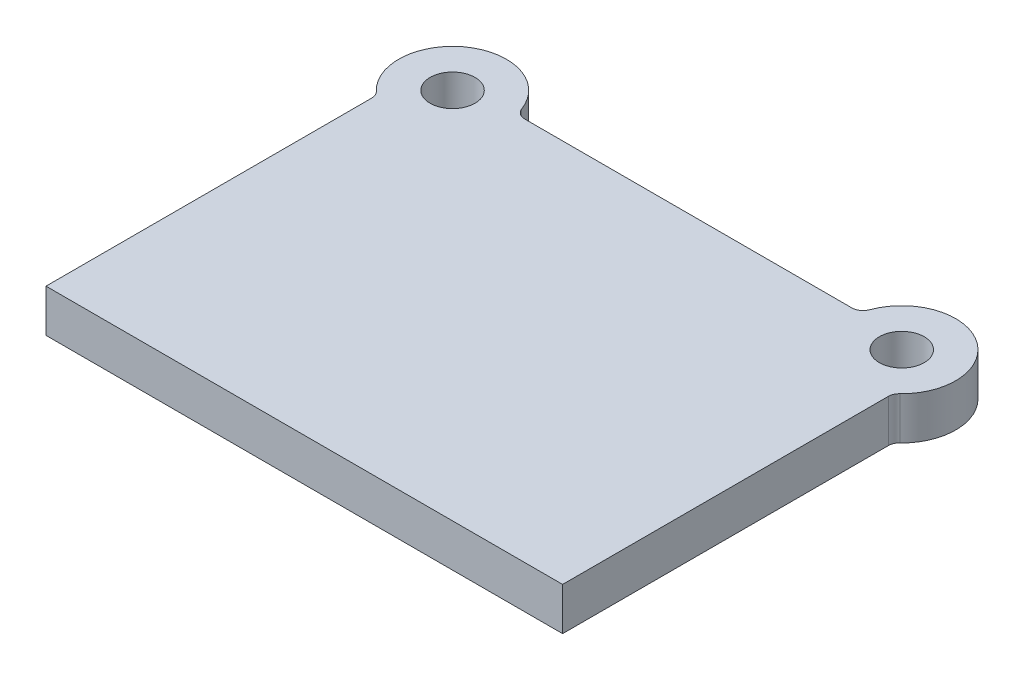
ISO-10303-21;
HEADER;
FILE_DESCRIPTION(('STEP AP214'),'2;1');
FILE_NAME('part.step','',(''),(''),'','','');
FILE_SCHEMA(('AUTOMOTIVE_DESIGN { 1 0 10303 214 1 1 1 1 }'));
ENDSEC;
DATA;
#1=APPLICATION_CONTEXT('core data for automotive mechanical design processes');
#2=APPLICATION_PROTOCOL_DEFINITION('international standard','automotive_design',2000,#1);
#3=PRODUCT_CONTEXT('',#1,'mechanical');
#4=PRODUCT('Part','Part','',(#3));
#5=PRODUCT_RELATED_PRODUCT_CATEGORY('part','',(#4));
#6=PRODUCT_DEFINITION_FORMATION('','',#4);
#7=PRODUCT_DEFINITION_CONTEXT('part definition',#1,'design');
#8=PRODUCT_DEFINITION('design','',#6,#7);
#9=PRODUCT_DEFINITION_SHAPE('','',#8);
#10=(LENGTH_UNIT() NAMED_UNIT(*) SI_UNIT(.MILLI.,.METRE.));
#11=(NAMED_UNIT(*) PLANE_ANGLE_UNIT() SI_UNIT($,.RADIAN.));
#12=(NAMED_UNIT(*) SI_UNIT($,.STERADIAN.) SOLID_ANGLE_UNIT());
#13=UNCERTAINTY_MEASURE_WITH_UNIT(LENGTH_MEASURE(1.E-05),#10,'distance_accuracy_value','');
#14=(GEOMETRIC_REPRESENTATION_CONTEXT(3) GLOBAL_UNCERTAINTY_ASSIGNED_CONTEXT((#13)) GLOBAL_UNIT_ASSIGNED_CONTEXT((#10,
#11,#12)) REPRESENTATION_CONTEXT('',''));
#15=CARTESIAN_POINT('',(0.,0.,0.));
#16=DIRECTION('',(0.,0.,1.));
#17=DIRECTION('',(1.,0.,0.));
#18=AXIS2_PLACEMENT_3D('',#15,#16,#17);
#19=CARTESIAN_POINT('',(-200.,38.,-332.));
#20=DIRECTION('',(0.,1.,0.));
#21=DIRECTION('',(0.,0.,1.));
#22=AXIS2_PLACEMENT_3D('',#19,#20,#21);
#23=PLANE('',#22);
#24=CARTESIAN_POINT('',(-200.,38.,-332.));
#25=DIRECTION('',(0.,1.,0.));
#26=DIRECTION('',(0.,0.,1.));
#27=AXIS2_PLACEMENT_3D('',#24,#25,#26);
#28=CIRCLE('',#27,20.);
#29=CARTESIAN_POINT('',(-200.,38.,-312.));
#30=VERTEX_POINT('',#29);
#31=EDGE_CURVE('E197',#30,#30,#28,.T.);
#32=ORIENTED_EDGE('',*,*,#31,.F.);
#33=EDGE_LOOP('',(#32));
#34=FACE_BOUND('',#33,.T.);
#35=CARTESIAN_POINT('',(-200.,38.,-332.));
#36=DIRECTION('',(0.,1.,0.));
#37=DIRECTION('',(0.,0.,1.));
#38=AXIS2_PLACEMENT_3D('',#35,#36,#37);
#39=CIRCLE('',#38,48.);
#40=CARTESIAN_POINT('',(-154.944030050815,38.,-348.551724137931));
#41=VERTEX_POINT('',#40);
#42=CARTESIAN_POINT('',(-233.103448275862,38.,-297.241379310345));
#43=VERTEX_POINT('',#42);
#44=EDGE_CURVE('E140',#41,#43,#39,.T.);
#45=ORIENTED_EDGE('',*,*,#44,.T.);
#46=CARTESIAN_POINT('',(-240.,38.,-290.));
#47=DIRECTION('',(0.,1.,0.));
#48=DIRECTION('',(0.,0.,1.));
#49=AXIS2_PLACEMENT_3D('',#46,#47,#48);
#50=CIRCLE('',#49,10.);
#51=CARTESIAN_POINT('',(-230.,38.,-290.));
#52=VERTEX_POINT('',#51);
#53=EDGE_CURVE('E116',#43,#52,#50,.F.);
#54=ORIENTED_EDGE('',*,*,#53,.T.);
#55=DIRECTION('',(0.,0.,1.));
#56=VECTOR('',#55,1.);
#57=CARTESIAN_POINT('',(-230.,38.,0.));
#58=LINE('',#57,#56);
#59=CARTESIAN_POINT('',(-230.,38.,0.));
#60=VERTEX_POINT('',#59);
#61=EDGE_CURVE('E108',#52,#60,#58,.T.);
#62=ORIENTED_EDGE('',*,*,#61,.T.);
#63=DIRECTION('',(1.,0.,0.));
#64=VECTOR('',#63,1.);
#65=CARTESIAN_POINT('',(230.,38.,0.));
#66=LINE('',#65,#64);
#67=CARTESIAN_POINT('',(230.,38.,0.));
#68=VERTEX_POINT('',#67);
#69=EDGE_CURVE('E113',#60,#68,#66,.T.);
#70=ORIENTED_EDGE('',*,*,#69,.T.);
#71=DIRECTION('',(0.,0.,-1.));
#72=VECTOR('',#71,1.);
#73=CARTESIAN_POINT('',(230.,38.,0.));
#74=LINE('',#73,#72);
#75=CARTESIAN_POINT('',(230.,38.,-290.));
#76=VERTEX_POINT('',#75);
#77=EDGE_CURVE('E130',#68,#76,#74,.T.);
#78=ORIENTED_EDGE('',*,*,#77,.T.);
#79=CARTESIAN_POINT('',(240.,38.,-290.));
#80=DIRECTION('',(0.,1.,0.));
#81=DIRECTION('',(0.,0.,1.));
#82=AXIS2_PLACEMENT_3D('',#79,#80,#81);
#83=CIRCLE('',#82,10.);
#84=CARTESIAN_POINT('',(233.103448275862,38.,-297.241379310345));
#85=VERTEX_POINT('',#84);
#86=EDGE_CURVE('E164',#76,#85,#83,.F.);
#87=ORIENTED_EDGE('',*,*,#86,.T.);
#88=CARTESIAN_POINT('',(200.,38.,-332.));
#89=DIRECTION('',(0.,1.,0.));
#90=DIRECTION('',(0.,0.,-1.));
#91=AXIS2_PLACEMENT_3D('',#88,#89,#90);
#92=CIRCLE('',#91,48.);
#93=CARTESIAN_POINT('',(154.944030050815,38.,-348.551724137931));
#94=VERTEX_POINT('',#93);
#95=EDGE_CURVE('E189',#85,#94,#92,.T.);
#96=ORIENTED_EDGE('',*,*,#95,.T.);
#97=CARTESIAN_POINT('',(145.557369644735,38.,-352.));
#98=DIRECTION('',(0.,1.,0.));
#99=DIRECTION('',(0.,0.,1.));
#100=AXIS2_PLACEMENT_3D('',#97,#98,#99);
#101=CIRCLE('',#100,10.);
#102=CARTESIAN_POINT('',(145.557369644735,38.,-342.));
#103=VERTEX_POINT('',#102);
#104=EDGE_CURVE('E11',#94,#103,#101,.F.);
#105=ORIENTED_EDGE('',*,*,#104,.T.);
#106=DIRECTION('',(-1.,0.,0.));
#107=VECTOR('',#106,1.);
#108=CARTESIAN_POINT('',(153.053221622778,38.,-342.));
#109=LINE('',#108,#107);
#110=CARTESIAN_POINT('',(-145.557369644735,38.,-342.));
#111=VERTEX_POINT('',#110);
#112=EDGE_CURVE('E187',#103,#111,#109,.T.);
#113=ORIENTED_EDGE('',*,*,#112,.T.);
#114=CARTESIAN_POINT('',(-145.557369644735,38.,-352.));
#115=DIRECTION('',(0.,1.,0.));
#116=DIRECTION('',(0.,0.,1.));
#117=AXIS2_PLACEMENT_3D('',#114,#115,#116);
#118=CIRCLE('',#117,10.);
#119=EDGE_CURVE('E168',#111,#41,#118,.F.);
#120=ORIENTED_EDGE('',*,*,#119,.T.);
#121=EDGE_LOOP('',(#45,#54,#62,#70,#78,#87,#96,#105,#113,#120));
#122=FACE_BOUND('',#121,.T.);
#123=CARTESIAN_POINT('',(200.,38.,-332.));
#124=DIRECTION('',(0.,1.,0.));
#125=DIRECTION('',(0.,0.,-1.));
#126=AXIS2_PLACEMENT_3D('',#123,#124,#125);
#127=CIRCLE('',#126,20.);
#128=CARTESIAN_POINT('',(200.,38.,-352.));
#129=VERTEX_POINT('',#128);
#130=EDGE_CURVE('E219',#129,#129,#127,.T.);
#131=ORIENTED_EDGE('',*,*,#130,.F.);
#132=EDGE_LOOP('',(#131));
#133=FACE_BOUND('',#132,.T.);
#134=ADVANCED_FACE('F33',(#34,#122,#133),#23,.T.);
#135=CARTESIAN_POINT('',(-200.,0.,-332.));
#136=DIRECTION('',(0.,1.,0.));
#137=DIRECTION('',(0.,0.,1.));
#138=AXIS2_PLACEMENT_3D('',#135,#136,#137);
#139=PLANE('',#138);
#140=DIRECTION('',(0.,0.,1.));
#141=VECTOR('',#140,1.);
#142=CARTESIAN_POINT('',(-230.,0.,0.));
#143=LINE('',#142,#141);
#144=CARTESIAN_POINT('',(-230.,0.,-290.));
#145=VERTEX_POINT('',#144);
#146=CARTESIAN_POINT('',(-230.,0.,0.));
#147=VERTEX_POINT('',#146);
#148=EDGE_CURVE('E134',#145,#147,#143,.T.);
#149=ORIENTED_EDGE('',*,*,#148,.F.);
#150=CARTESIAN_POINT('',(-240.,0.,-290.));
#151=DIRECTION('',(0.,1.,0.));
#152=DIRECTION('',(0.,0.,1.));
#153=AXIS2_PLACEMENT_3D('',#150,#151,#152);
#154=CIRCLE('',#153,10.);
#155=CARTESIAN_POINT('',(-233.103448275862,0.,-297.241379310345));
#156=VERTEX_POINT('',#155);
#157=EDGE_CURVE('E159',#145,#156,#154,.T.);
#158=ORIENTED_EDGE('',*,*,#157,.T.);
#159=CARTESIAN_POINT('',(-200.,0.,-332.));
#160=DIRECTION('',(0.,1.,0.));
#161=DIRECTION('',(0.,0.,1.));
#162=AXIS2_PLACEMENT_3D('',#159,#160,#161);
#163=CIRCLE('',#162,48.);
#164=CARTESIAN_POINT('',(-154.944030050815,0.,-348.551724137931));
#165=VERTEX_POINT('',#164);
#166=EDGE_CURVE('E121',#165,#156,#163,.T.);
#167=ORIENTED_EDGE('',*,*,#166,.F.);
#168=CARTESIAN_POINT('',(-145.557369644735,0.,-352.));
#169=DIRECTION('',(0.,1.,0.));
#170=DIRECTION('',(0.,0.,1.));
#171=AXIS2_PLACEMENT_3D('',#168,#169,#170);
#172=CIRCLE('',#171,10.);
#173=CARTESIAN_POINT('',(-145.557369644735,0.,-342.));
#174=VERTEX_POINT('',#173);
#175=EDGE_CURVE('E166',#165,#174,#172,.T.);
#176=ORIENTED_EDGE('',*,*,#175,.T.);
#177=DIRECTION('',(-1.,0.,0.));
#178=VECTOR('',#177,1.);
#179=CARTESIAN_POINT('',(153.053221622778,0.,-342.));
#180=LINE('',#179,#178);
#181=CARTESIAN_POINT('',(145.557369644735,0.,-342.));
#182=VERTEX_POINT('',#181);
#183=EDGE_CURVE('E176',#182,#174,#180,.T.);
#184=ORIENTED_EDGE('',*,*,#183,.F.);
#185=CARTESIAN_POINT('',(145.557369644735,0.,-352.));
#186=DIRECTION('',(0.,1.,0.));
#187=DIRECTION('',(0.,0.,1.));
#188=AXIS2_PLACEMENT_3D('',#185,#186,#187);
#189=CIRCLE('',#188,10.);
#190=CARTESIAN_POINT('',(154.944030050815,0.,-348.551724137931));
#191=VERTEX_POINT('',#190);
#192=EDGE_CURVE('E41',#182,#191,#189,.T.);
#193=ORIENTED_EDGE('',*,*,#192,.T.);
#194=CARTESIAN_POINT('',(200.,0.,-332.));
#195=DIRECTION('',(0.,1.,0.));
#196=DIRECTION('',(0.,0.,-1.));
#197=AXIS2_PLACEMENT_3D('',#194,#195,#196);
#198=CIRCLE('',#197,48.);
#199=CARTESIAN_POINT('',(233.103448275862,0.,-297.241379310345));
#200=VERTEX_POINT('',#199);
#201=EDGE_CURVE('E175',#200,#191,#198,.T.);
#202=ORIENTED_EDGE('',*,*,#201,.F.);
#203=CARTESIAN_POINT('',(240.,0.,-290.));
#204=DIRECTION('',(0.,1.,0.));
#205=DIRECTION('',(0.,0.,1.));
#206=AXIS2_PLACEMENT_3D('',#203,#204,#205);
#207=CIRCLE('',#206,10.);
#208=CARTESIAN_POINT('',(230.,0.,-290.));
#209=VERTEX_POINT('',#208);
#210=EDGE_CURVE('E162',#200,#209,#207,.T.);
#211=ORIENTED_EDGE('',*,*,#210,.T.);
#212=DIRECTION('',(0.,0.,-1.));
#213=VECTOR('',#212,1.);
#214=CARTESIAN_POINT('',(230.,0.,0.));
#215=LINE('',#214,#213);
#216=CARTESIAN_POINT('',(230.,0.,0.));
#217=VERTEX_POINT('',#216);
#218=EDGE_CURVE('E184',#217,#209,#215,.T.);
#219=ORIENTED_EDGE('',*,*,#218,.F.);
#220=DIRECTION('',(1.,0.,0.));
#221=VECTOR('',#220,1.);
#222=CARTESIAN_POINT('',(230.,0.,0.));
#223=LINE('',#222,#221);
#224=EDGE_CURVE('E196',#147,#217,#223,.T.);
#225=ORIENTED_EDGE('',*,*,#224,.F.);
#226=EDGE_LOOP('',(#149,#158,#167,#176,#184,#193,#202,#211,#219,#225));
#227=FACE_BOUND('',#226,.T.);
#228=CARTESIAN_POINT('',(-200.,0.,-332.));
#229=DIRECTION('',(0.,1.,0.));
#230=DIRECTION('',(0.,0.,1.));
#231=AXIS2_PLACEMENT_3D('',#228,#229,#230);
#232=CIRCLE('',#231,20.);
#233=CARTESIAN_POINT('',(-200.,0.,-312.));
#234=VERTEX_POINT('',#233);
#235=EDGE_CURVE('E216',#234,#234,#232,.T.);
#236=ORIENTED_EDGE('',*,*,#235,.T.);
#237=EDGE_LOOP('',(#236));
#238=FACE_BOUND('',#237,.T.);
#239=CARTESIAN_POINT('',(200.,0.,-332.));
#240=DIRECTION('',(0.,1.,0.));
#241=DIRECTION('',(0.,0.,-1.));
#242=AXIS2_PLACEMENT_3D('',#239,#240,#241);
#243=CIRCLE('',#242,20.);
#244=CARTESIAN_POINT('',(200.,0.,-352.));
#245=VERTEX_POINT('',#244);
#246=EDGE_CURVE('E222',#245,#245,#243,.T.);
#247=ORIENTED_EDGE('',*,*,#246,.T.);
#248=EDGE_LOOP('',(#247));
#249=FACE_BOUND('',#248,.T.);
#250=ADVANCED_FACE('F173',(#227,#238,#249),#139,.F.);
#251=CARTESIAN_POINT('',(-230.,38.,0.));
#252=DIRECTION('',(1.,0.,0.));
#253=DIRECTION('',(0.,0.,-1.));
#254=AXIS2_PLACEMENT_3D('',#251,#252,#253);
#255=PLANE('',#254);
#256=ORIENTED_EDGE('',*,*,#61,.F.);
#257=DIRECTION('',(0.,1.,0.));
#258=VECTOR('',#257,1.);
#259=CARTESIAN_POINT('',(-230.,0.,-290.));
#260=LINE('',#259,#258);
#261=EDGE_CURVE('E136',#52,#145,#260,.F.);
#262=ORIENTED_EDGE('',*,*,#261,.T.);
#263=ORIENTED_EDGE('',*,*,#148,.T.);
#264=DIRECTION('',(0.,-1.,0.));
#265=VECTOR('',#264,1.);
#266=CARTESIAN_POINT('',(-230.,38.,0.));
#267=LINE('',#266,#265);
#268=EDGE_CURVE('E126',#60,#147,#267,.T.);
#269=ORIENTED_EDGE('',*,*,#268,.F.);
#270=EDGE_LOOP('',(#256,#262,#263,#269));
#271=FACE_BOUND('',#270,.T.);
#272=ADVANCED_FACE('F132',(#271),#255,.F.);
#273=CARTESIAN_POINT('',(230.,38.,0.));
#274=DIRECTION('',(0.,0.,-1.));
#275=DIRECTION('',(-1.,0.,0.));
#276=AXIS2_PLACEMENT_3D('',#273,#274,#275);
#277=PLANE('',#276);
#278=ORIENTED_EDGE('',*,*,#224,.T.);
#279=DIRECTION('',(0.,-1.,0.));
#280=VECTOR('',#279,1.);
#281=CARTESIAN_POINT('',(230.,38.,0.));
#282=LINE('',#281,#280);
#283=EDGE_CURVE('E128',#68,#217,#282,.T.);
#284=ORIENTED_EDGE('',*,*,#283,.F.);
#285=ORIENTED_EDGE('',*,*,#69,.F.);
#286=ORIENTED_EDGE('',*,*,#268,.T.);
#287=EDGE_LOOP('',(#278,#284,#285,#286));
#288=FACE_BOUND('',#287,.T.);
#289=ADVANCED_FACE('F125',(#288),#277,.F.);
#290=CARTESIAN_POINT('',(230.,38.,0.));
#291=DIRECTION('',(-1.,0.,0.));
#292=DIRECTION('',(0.,0.,1.));
#293=AXIS2_PLACEMENT_3D('',#290,#291,#292);
#294=PLANE('',#293);
#295=ORIENTED_EDGE('',*,*,#218,.T.);
#296=DIRECTION('',(0.,1.,0.));
#297=VECTOR('',#296,1.);
#298=CARTESIAN_POINT('',(230.,38.,-290.));
#299=LINE('',#298,#297);
#300=EDGE_CURVE('E153',#209,#76,#299,.T.);
#301=ORIENTED_EDGE('',*,*,#300,.T.);
#302=ORIENTED_EDGE('',*,*,#77,.F.);
#303=ORIENTED_EDGE('',*,*,#283,.T.);
#304=EDGE_LOOP('',(#295,#301,#302,#303));
#305=FACE_BOUND('',#304,.T.);
#306=ADVANCED_FACE('F212',(#305),#294,.F.);
#307=CARTESIAN_POINT('',(200.,38.,-332.));
#308=DIRECTION('',(0.,-1.,0.));
#309=DIRECTION('',(0.,0.,-1.));
#310=AXIS2_PLACEMENT_3D('',#307,#308,#309);
#311=CYLINDRICAL_SURFACE('',#310,48.);
#312=ORIENTED_EDGE('',*,*,#95,.F.);
#313=DIRECTION('',(0.,-1.,0.));
#314=VECTOR('',#313,1.);
#315=CARTESIAN_POINT('',(233.103448275862,38.,-297.241379310345));
#316=LINE('',#315,#314);
#317=EDGE_CURVE('E150',#85,#200,#316,.T.);
#318=ORIENTED_EDGE('',*,*,#317,.T.);
#319=ORIENTED_EDGE('',*,*,#201,.T.);
#320=DIRECTION('',(0.,-1.,0.));
#321=VECTOR('',#320,1.);
#322=CARTESIAN_POINT('',(154.944030050815,38.,-348.551724137931));
#323=LINE('',#322,#321);
#324=EDGE_CURVE('E148',#191,#94,#323,.F.);
#325=ORIENTED_EDGE('',*,*,#324,.T.);
#326=EDGE_LOOP('',(#312,#318,#319,#325));
#327=FACE_BOUND('',#326,.T.);
#328=ADVANCED_FACE('F182',(#327),#311,.T.);
#329=CARTESIAN_POINT('',(153.053221622778,38.,-342.));
#330=DIRECTION('',(0.,0.,1.));
#331=DIRECTION('',(1.,0.,0.));
#332=AXIS2_PLACEMENT_3D('',#329,#330,#331);
#333=PLANE('',#332);
#334=ORIENTED_EDGE('',*,*,#183,.T.);
#335=DIRECTION('',(0.,1.,0.));
#336=VECTOR('',#335,1.);
#337=CARTESIAN_POINT('',(-145.557369644735,38.,-342.));
#338=LINE('',#337,#336);
#339=EDGE_CURVE('E48',#174,#111,#338,.T.);
#340=ORIENTED_EDGE('',*,*,#339,.T.);
#341=ORIENTED_EDGE('',*,*,#112,.F.);
#342=DIRECTION('',(0.,1.,0.));
#343=VECTOR('',#342,1.);
#344=CARTESIAN_POINT('',(145.557369644735,0.,-342.));
#345=LINE('',#344,#343);
#346=EDGE_CURVE('E155',#103,#182,#345,.F.);
#347=ORIENTED_EDGE('',*,*,#346,.T.);
#348=EDGE_LOOP('',(#334,#340,#341,#347));
#349=FACE_BOUND('',#348,.T.);
#350=ADVANCED_FACE('F186',(#349),#333,.F.);
#351=CARTESIAN_POINT('',(-200.,38.,-332.));
#352=DIRECTION('',(0.,-1.,0.));
#353=DIRECTION('',(0.,0.,-1.));
#354=AXIS2_PLACEMENT_3D('',#351,#352,#353);
#355=CYLINDRICAL_SURFACE('',#354,48.);
#356=ORIENTED_EDGE('',*,*,#166,.T.);
#357=DIRECTION('',(0.,-1.,0.));
#358=VECTOR('',#357,1.);
#359=CARTESIAN_POINT('',(-233.103448275862,38.,-297.241379310345));
#360=LINE('',#359,#358);
#361=EDGE_CURVE('E146',#156,#43,#360,.F.);
#362=ORIENTED_EDGE('',*,*,#361,.T.);
#363=ORIENTED_EDGE('',*,*,#44,.F.);
#364=DIRECTION('',(0.,-1.,0.));
#365=VECTOR('',#364,1.);
#366=CARTESIAN_POINT('',(-154.944030050815,38.,-348.551724137931));
#367=LINE('',#366,#365);
#368=EDGE_CURVE('E138',#41,#165,#367,.T.);
#369=ORIENTED_EDGE('',*,*,#368,.T.);
#370=EDGE_LOOP('',(#356,#362,#363,#369));
#371=FACE_BOUND('',#370,.T.);
#372=ADVANCED_FACE('F205',(#371),#355,.T.);
#373=CARTESIAN_POINT('',(-200.,38.,-332.));
#374=DIRECTION('',(0.,-1.,0.));
#375=DIRECTION('',(0.,0.,-1.));
#376=AXIS2_PLACEMENT_3D('',#373,#374,#375);
#377=CYLINDRICAL_SURFACE('',#376,20.);
#378=ORIENTED_EDGE('',*,*,#31,.T.);
#379=EDGE_LOOP('',(#378));
#380=FACE_BOUND('',#379,.T.);
#381=ORIENTED_EDGE('',*,*,#235,.F.);
#382=EDGE_LOOP('',(#381));
#383=FACE_BOUND('',#382,.T.);
#384=ADVANCED_FACE('F239',(#380,#383),#377,.F.);
#385=CARTESIAN_POINT('',(200.,38.,-332.));
#386=DIRECTION('',(0.,-1.,0.));
#387=DIRECTION('',(0.,0.,-1.));
#388=AXIS2_PLACEMENT_3D('',#385,#386,#387);
#389=CYLINDRICAL_SURFACE('',#388,20.);
#390=ORIENTED_EDGE('',*,*,#130,.T.);
#391=EDGE_LOOP('',(#390));
#392=FACE_BOUND('',#391,.T.);
#393=ORIENTED_EDGE('',*,*,#246,.F.);
#394=EDGE_LOOP('',(#393));
#395=FACE_BOUND('',#394,.T.);
#396=ADVANCED_FACE('F228',(#392,#395),#389,.F.);
#397=CARTESIAN_POINT('',(-240.,38.,-290.));
#398=DIRECTION('',(0.,-1.,0.));
#399=DIRECTION('',(0.,0.,-1.));
#400=AXIS2_PLACEMENT_3D('',#397,#398,#399);
#401=CYLINDRICAL_SURFACE('',#400,10.);
#402=ORIENTED_EDGE('',*,*,#53,.F.);
#403=ORIENTED_EDGE('',*,*,#361,.F.);
#404=ORIENTED_EDGE('',*,*,#157,.F.);
#405=ORIENTED_EDGE('',*,*,#261,.F.);
#406=EDGE_LOOP('',(#402,#403,#404,#405));
#407=FACE_BOUND('',#406,.T.);
#408=ADVANCED_FACE('F209',(#407),#401,.F.);
#409=CARTESIAN_POINT('',(240.,38.,-290.));
#410=DIRECTION('',(0.,-1.,0.));
#411=DIRECTION('',(0.,0.,-1.));
#412=AXIS2_PLACEMENT_3D('',#409,#410,#411);
#413=CYLINDRICAL_SURFACE('',#412,10.);
#414=ORIENTED_EDGE('',*,*,#86,.F.);
#415=ORIENTED_EDGE('',*,*,#300,.F.);
#416=ORIENTED_EDGE('',*,*,#210,.F.);
#417=ORIENTED_EDGE('',*,*,#317,.F.);
#418=EDGE_LOOP('',(#414,#415,#416,#417));
#419=FACE_BOUND('',#418,.T.);
#420=ADVANCED_FACE('F256',(#419),#413,.F.);
#421=CARTESIAN_POINT('',(-145.557369644735,38.,-352.));
#422=DIRECTION('',(0.,-1.,0.));
#423=DIRECTION('',(0.,0.,-1.));
#424=AXIS2_PLACEMENT_3D('',#421,#422,#423);
#425=CYLINDRICAL_SURFACE('',#424,10.);
#426=ORIENTED_EDGE('',*,*,#119,.F.);
#427=ORIENTED_EDGE('',*,*,#339,.F.);
#428=ORIENTED_EDGE('',*,*,#175,.F.);
#429=ORIENTED_EDGE('',*,*,#368,.F.);
#430=EDGE_LOOP('',(#426,#427,#428,#429));
#431=FACE_BOUND('',#430,.T.);
#432=ADVANCED_FACE('F258',(#431),#425,.F.);
#433=CARTESIAN_POINT('',(145.557369644735,38.,-352.));
#434=DIRECTION('',(0.,-1.,0.));
#435=DIRECTION('',(0.,0.,-1.));
#436=AXIS2_PLACEMENT_3D('',#433,#434,#435);
#437=CYLINDRICAL_SURFACE('',#436,10.);
#438=ORIENTED_EDGE('',*,*,#104,.F.);
#439=ORIENTED_EDGE('',*,*,#324,.F.);
#440=ORIENTED_EDGE('',*,*,#192,.F.);
#441=ORIENTED_EDGE('',*,*,#346,.F.);
#442=EDGE_LOOP('',(#438,#439,#440,#441));
#443=FACE_BOUND('',#442,.T.);
#444=ADVANCED_FACE('F35',(#443),#437,.F.);
#445=CLOSED_SHELL('',(#134,#250,#272,#289,#306,#328,#350,#372,#384,#396,#408,#420,#432,#444));
#446=MANIFOLD_SOLID_BREP('B2',#445);
#447=ADVANCED_BREP_SHAPE_REPRESENTATION('',(#18,#446),#14);
#448=SHAPE_DEFINITION_REPRESENTATION(#9,#447);
ENDSEC;
END-ISO-10303-21;
